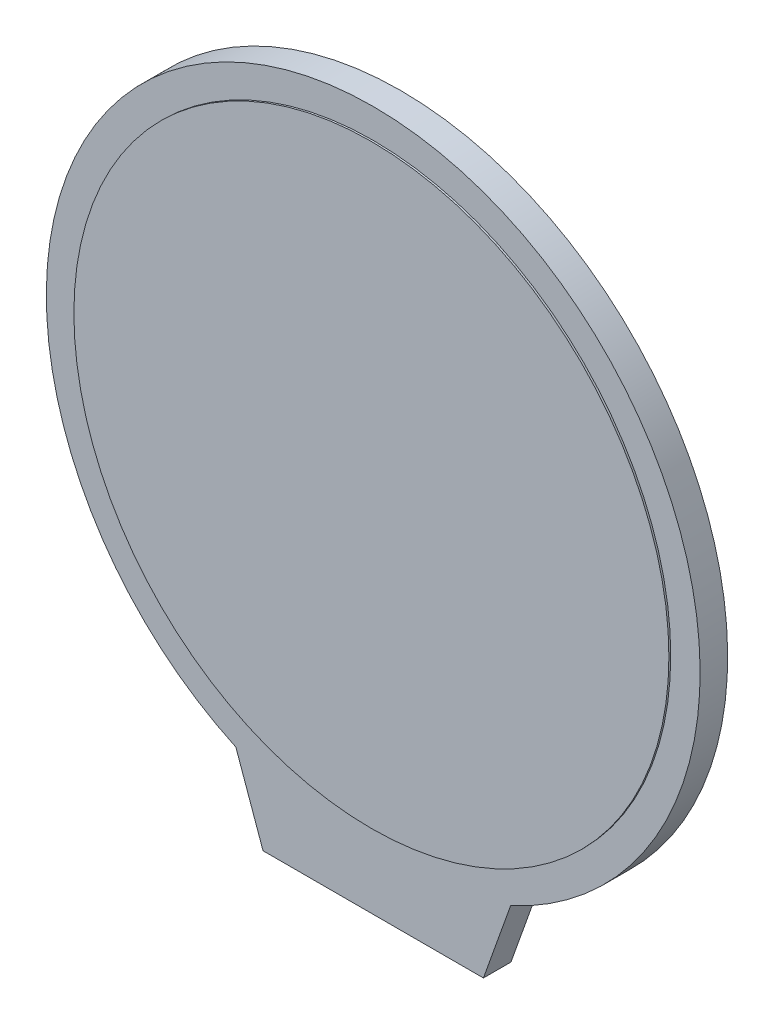
ISO-10303-21;
HEADER;
FILE_DESCRIPTION(('STEP AP214'),'2;1');
FILE_NAME('part.step','',(''),(''),'','','');
FILE_SCHEMA(('AUTOMOTIVE_DESIGN { 1 0 10303 214 1 1 1 1 }'));
ENDSEC;
DATA;
#1=APPLICATION_CONTEXT('core data for automotive mechanical design processes');
#2=APPLICATION_PROTOCOL_DEFINITION('international standard','automotive_design',2000,#1);
#3=PRODUCT_CONTEXT('',#1,'mechanical');
#4=PRODUCT('Part','Part','',(#3));
#5=PRODUCT_RELATED_PRODUCT_CATEGORY('part','',(#4));
#6=PRODUCT_DEFINITION_FORMATION('','',#4);
#7=PRODUCT_DEFINITION_CONTEXT('part definition',#1,'design');
#8=PRODUCT_DEFINITION('design','',#6,#7);
#9=PRODUCT_DEFINITION_SHAPE('','',#8);
#10=(LENGTH_UNIT() NAMED_UNIT(*) SI_UNIT(.MILLI.,.METRE.));
#11=(NAMED_UNIT(*) PLANE_ANGLE_UNIT() SI_UNIT($,.RADIAN.));
#12=(NAMED_UNIT(*) SI_UNIT($,.STERADIAN.) SOLID_ANGLE_UNIT());
#13=UNCERTAINTY_MEASURE_WITH_UNIT(LENGTH_MEASURE(1.E-05),#10,'distance_accuracy_value','');
#14=(GEOMETRIC_REPRESENTATION_CONTEXT(3) GLOBAL_UNCERTAINTY_ASSIGNED_CONTEXT((#13)) GLOBAL_UNIT_ASSIGNED_CONTEXT((#10,
#11,#12)) REPRESENTATION_CONTEXT('',''));
#15=CARTESIAN_POINT('',(0.,0.,0.));
#16=DIRECTION('',(0.,0.,1.));
#17=DIRECTION('',(1.,0.,0.));
#18=AXIS2_PLACEMENT_3D('',#15,#16,#17);
#19=CARTESIAN_POINT('',(0.,0.,1.5));
#20=DIRECTION('',(0.,0.,-1.));
#21=DIRECTION('',(-1.,0.,0.));
#22=AXIS2_PLACEMENT_3D('',#19,#20,#21);
#23=CYLINDRICAL_SURFACE('',#22,17.8);
#24=CARTESIAN_POINT('',(0.,0.,0.));
#25=DIRECTION('',(0.,0.,1.));
#26=DIRECTION('',(1.,0.,0.));
#27=AXIS2_PLACEMENT_3D('',#24,#25,#26);
#28=CIRCLE('',#27,17.8);
#29=CARTESIAN_POINT('',(7.47977324948753,-16.152182271639,0.));
#30=VERTEX_POINT('',#29);
#31=CARTESIAN_POINT('',(-7.47977324948752,-16.152182271639,0.));
#32=VERTEX_POINT('',#31);
#33=EDGE_CURVE('E112',#30,#32,#28,.T.);
#34=ORIENTED_EDGE('',*,*,#33,.T.);
#35=DIRECTION('',(0.,0.,-1.));
#36=VECTOR('',#35,1.);
#37=CARTESIAN_POINT('',(-7.47977324948752,-16.152182271639,1.5));
#38=LINE('',#37,#36);
#39=CARTESIAN_POINT('',(-7.47977324948752,-16.152182271639,1.5));
#40=VERTEX_POINT('',#39);
#41=EDGE_CURVE('E44',#40,#32,#38,.T.);
#42=ORIENTED_EDGE('',*,*,#41,.F.);
#43=CARTESIAN_POINT('',(0.,0.,1.5));
#44=DIRECTION('',(0.,0.,1.));
#45=DIRECTION('',(1.,0.,0.));
#46=AXIS2_PLACEMENT_3D('',#43,#44,#45);
#47=CIRCLE('',#46,17.8);
#48=CARTESIAN_POINT('',(7.47977324948753,-16.152182271639,1.5));
#49=VERTEX_POINT('',#48);
#50=EDGE_CURVE('E95',#49,#40,#47,.T.);
#51=ORIENTED_EDGE('',*,*,#50,.F.);
#52=DIRECTION('',(0.,0.,-1.));
#53=VECTOR('',#52,1.);
#54=CARTESIAN_POINT('',(7.47977324948753,-16.152182271639,1.5));
#55=LINE('',#54,#53);
#56=EDGE_CURVE('E108',#49,#30,#55,.T.);
#57=ORIENTED_EDGE('',*,*,#56,.T.);
#58=EDGE_LOOP('',(#34,#42,#51,#57));
#59=FACE_BOUND('',#58,.T.);
#60=ADVANCED_FACE('F41',(#59),#23,.T.);
#61=CARTESIAN_POINT('',(-6.,-20.3,1.5));
#62=DIRECTION('',(0.941856231660545,0.33601612890187,0.));
#63=DIRECTION('',(-0.33601612890187,0.941856231660545,0.));
#64=AXIS2_PLACEMENT_3D('',#61,#62,#63);
#65=PLANE('',#64);
#66=DIRECTION('',(0.33601612890187,-0.941856231660545,0.));
#67=VECTOR('',#66,1.);
#68=CARTESIAN_POINT('',(-6.,-20.3,0.));
#69=LINE('',#68,#67);
#70=CARTESIAN_POINT('',(-6.,-20.3,0.));
#71=VERTEX_POINT('',#70);
#72=EDGE_CURVE('E101',#32,#71,#69,.T.);
#73=ORIENTED_EDGE('',*,*,#72,.T.);
#74=DIRECTION('',(0.,0.,-1.));
#75=VECTOR('',#74,1.);
#76=CARTESIAN_POINT('',(-6.,-20.3,1.5));
#77=LINE('',#76,#75);
#78=CARTESIAN_POINT('',(-6.,-20.3,1.5));
#79=VERTEX_POINT('',#78);
#80=EDGE_CURVE('E99',#79,#71,#77,.T.);
#81=ORIENTED_EDGE('',*,*,#80,.F.);
#82=DIRECTION('',(0.33601612890187,-0.941856231660545,0.));
#83=VECTOR('',#82,1.);
#84=CARTESIAN_POINT('',(-6.,-20.3,1.5));
#85=LINE('',#84,#83);
#86=EDGE_CURVE('E90',#40,#79,#85,.T.);
#87=ORIENTED_EDGE('',*,*,#86,.F.);
#88=ORIENTED_EDGE('',*,*,#41,.T.);
#89=EDGE_LOOP('',(#73,#81,#87,#88));
#90=FACE_BOUND('',#89,.T.);
#91=ADVANCED_FACE('F100',(#90),#65,.F.);
#92=CARTESIAN_POINT('',(-6.,-20.3,1.5));
#93=DIRECTION('',(0.,1.,0.));
#94=DIRECTION('',(-1.,0.,0.));
#95=AXIS2_PLACEMENT_3D('',#92,#93,#94);
#96=PLANE('',#95);
#97=DIRECTION('',(1.,0.,0.));
#98=VECTOR('',#97,1.);
#99=CARTESIAN_POINT('',(-6.,-20.3,0.));
#100=LINE('',#99,#98);
#101=CARTESIAN_POINT('',(6.,-20.3,0.));
#102=VERTEX_POINT('',#101);
#103=EDGE_CURVE('E76',#71,#102,#100,.T.);
#104=ORIENTED_EDGE('',*,*,#103,.T.);
#105=DIRECTION('',(0.,0.,-1.));
#106=VECTOR('',#105,1.);
#107=CARTESIAN_POINT('',(6.,-20.3,1.5));
#108=LINE('',#107,#106);
#109=CARTESIAN_POINT('',(6.,-20.3,1.5));
#110=VERTEX_POINT('',#109);
#111=EDGE_CURVE('E103',#110,#102,#108,.T.);
#112=ORIENTED_EDGE('',*,*,#111,.F.);
#113=DIRECTION('',(1.,0.,0.));
#114=VECTOR('',#113,1.);
#115=CARTESIAN_POINT('',(-6.,-20.3,1.5));
#116=LINE('',#115,#114);
#117=EDGE_CURVE('E93',#79,#110,#116,.T.);
#118=ORIENTED_EDGE('',*,*,#117,.F.);
#119=ORIENTED_EDGE('',*,*,#80,.T.);
#120=EDGE_LOOP('',(#104,#112,#118,#119));
#121=FACE_BOUND('',#120,.T.);
#122=ADVANCED_FACE('F104',(#121),#96,.F.);
#123=CARTESIAN_POINT('',(6.,-20.3,1.5));
#124=DIRECTION('',(-0.941856231660545,0.33601612890187,0.));
#125=DIRECTION('',(-0.33601612890187,-0.941856231660545,0.));
#126=AXIS2_PLACEMENT_3D('',#123,#124,#125);
#127=PLANE('',#126);
#128=DIRECTION('',(0.33601612890187,0.941856231660545,0.));
#129=VECTOR('',#128,1.);
#130=CARTESIAN_POINT('',(6.,-20.3,0.));
#131=LINE('',#130,#129);
#132=EDGE_CURVE('E82',#102,#30,#131,.T.);
#133=ORIENTED_EDGE('',*,*,#132,.T.);
#134=ORIENTED_EDGE('',*,*,#56,.F.);
#135=DIRECTION('',(0.33601612890187,0.941856231660545,0.));
#136=VECTOR('',#135,1.);
#137=CARTESIAN_POINT('',(6.,-20.3,1.5));
#138=LINE('',#137,#136);
#139=EDGE_CURVE('E59',#110,#49,#138,.T.);
#140=ORIENTED_EDGE('',*,*,#139,.F.);
#141=ORIENTED_EDGE('',*,*,#111,.T.);
#142=EDGE_LOOP('',(#133,#134,#140,#141));
#143=FACE_BOUND('',#142,.T.);
#144=ADVANCED_FACE('F126',(#143),#127,.F.);
#145=CARTESIAN_POINT('',(0.,0.,1.5));
#146=DIRECTION('',(0.,0.,1.));
#147=DIRECTION('',(1.,0.,0.));
#148=AXIS2_PLACEMENT_3D('',#145,#146,#147);
#149=PLANE('',#148);
#150=CARTESIAN_POINT('',(0.,0.,1.5));
#151=DIRECTION('',(0.,0.,1.));
#152=DIRECTION('',(1.,0.,0.));
#153=AXIS2_PLACEMENT_3D('',#150,#151,#152);
#154=CIRCLE('',#153,16.2);
#155=CARTESIAN_POINT('',(16.2,0.,1.5));
#156=VERTEX_POINT('',#155);
#157=EDGE_CURVE('E11',#156,#156,#154,.T.);
#158=ORIENTED_EDGE('',*,*,#157,.F.);
#159=EDGE_LOOP('',(#158));
#160=FACE_BOUND('',#159,.T.);
#161=ORIENTED_EDGE('',*,*,#50,.T.);
#162=ORIENTED_EDGE('',*,*,#86,.T.);
#163=ORIENTED_EDGE('',*,*,#117,.T.);
#164=ORIENTED_EDGE('',*,*,#139,.T.);
#165=EDGE_LOOP('',(#161,#162,#163,#164));
#166=FACE_BOUND('',#165,.T.);
#167=ADVANCED_FACE('F91',(#160,#166),#149,.T.);
#168=CARTESIAN_POINT('',(0.,0.,0.));
#169=DIRECTION('',(0.,0.,1.));
#170=DIRECTION('',(1.,0.,0.));
#171=AXIS2_PLACEMENT_3D('',#168,#169,#170);
#172=PLANE('',#171);
#173=ORIENTED_EDGE('',*,*,#33,.F.);
#174=ORIENTED_EDGE('',*,*,#132,.F.);
#175=ORIENTED_EDGE('',*,*,#103,.F.);
#176=ORIENTED_EDGE('',*,*,#72,.F.);
#177=EDGE_LOOP('',(#173,#174,#175,#176));
#178=FACE_BOUND('',#177,.T.);
#179=ADVANCED_FACE('F129',(#178),#172,.F.);
#180=CARTESIAN_POINT('',(0.,0.,1.6));
#181=DIRECTION('',(0.,0.,-1.));
#182=DIRECTION('',(-1.,0.,0.));
#183=AXIS2_PLACEMENT_3D('',#180,#181,#182);
#184=CYLINDRICAL_SURFACE('',#183,16.2);
#185=CARTESIAN_POINT('',(0.,0.,1.6));
#186=DIRECTION('',(0.,0.,1.));
#187=DIRECTION('',(1.,0.,0.));
#188=AXIS2_PLACEMENT_3D('',#185,#186,#187);
#189=CIRCLE('',#188,16.2);
#190=CARTESIAN_POINT('',(16.2,0.,1.6));
#191=VERTEX_POINT('',#190);
#192=EDGE_CURVE('E116',#191,#191,#189,.T.);
#193=ORIENTED_EDGE('',*,*,#192,.F.);
#194=EDGE_LOOP('',(#193));
#195=FACE_BOUND('',#194,.T.);
#196=ORIENTED_EDGE('',*,*,#157,.T.);
#197=EDGE_LOOP('',(#196));
#198=FACE_BOUND('',#197,.T.);
#199=ADVANCED_FACE('F139',(#195,#198),#184,.T.);
#200=CARTESIAN_POINT('',(0.,0.,1.6));
#201=DIRECTION('',(0.,0.,1.));
#202=DIRECTION('',(1.,0.,0.));
#203=AXIS2_PLACEMENT_3D('',#200,#201,#202);
#204=PLANE('',#203);
#205=ORIENTED_EDGE('',*,*,#192,.T.);
#206=EDGE_LOOP('',(#205));
#207=FACE_BOUND('',#206,.T.);
#208=ADVANCED_FACE('F137',(#207),#204,.T.);
#209=CLOSED_SHELL('',(#60,#91,#122,#144,#167,#179,#199,#208));
#210=MANIFOLD_SOLID_BREP('B2',#209);
#211=ADVANCED_BREP_SHAPE_REPRESENTATION('',(#18,#210),#14);
#212=SHAPE_DEFINITION_REPRESENTATION(#9,#211);
ENDSEC;
END-ISO-10303-21;
